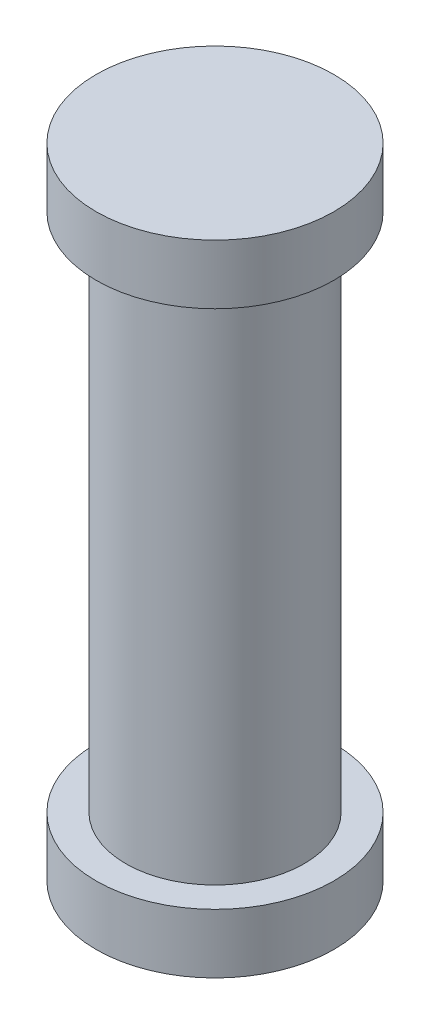
ISO-10303-21;
HEADER;
FILE_DESCRIPTION(('STEP AP214'),'2;1');
FILE_NAME('part.step','',(''),(''),'','','');
FILE_SCHEMA(('AUTOMOTIVE_DESIGN { 1 0 10303 214 1 1 1 1 }'));
ENDSEC;
DATA;
#1=APPLICATION_CONTEXT('core data for automotive mechanical design processes');
#2=APPLICATION_PROTOCOL_DEFINITION('international standard','automotive_design',2000,#1);
#3=PRODUCT_CONTEXT('',#1,'mechanical');
#4=PRODUCT('Part','Part','',(#3));
#5=PRODUCT_RELATED_PRODUCT_CATEGORY('part','',(#4));
#6=PRODUCT_DEFINITION_FORMATION('','',#4);
#7=PRODUCT_DEFINITION_CONTEXT('part definition',#1,'design');
#8=PRODUCT_DEFINITION('design','',#6,#7);
#9=PRODUCT_DEFINITION_SHAPE('','',#8);
#10=(LENGTH_UNIT() NAMED_UNIT(*) SI_UNIT(.MILLI.,.METRE.));
#11=(NAMED_UNIT(*) PLANE_ANGLE_UNIT() SI_UNIT($,.RADIAN.));
#12=(NAMED_UNIT(*) SI_UNIT($,.STERADIAN.) SOLID_ANGLE_UNIT());
#13=UNCERTAINTY_MEASURE_WITH_UNIT(LENGTH_MEASURE(1.E-05),#10,'distance_accuracy_value','');
#14=(GEOMETRIC_REPRESENTATION_CONTEXT(3) GLOBAL_UNCERTAINTY_ASSIGNED_CONTEXT((#13)) GLOBAL_UNIT_ASSIGNED_CONTEXT((#10,
#11,#12)) REPRESENTATION_CONTEXT('',''));
#15=CARTESIAN_POINT('',(0.,0.,0.));
#16=DIRECTION('',(0.,0.,1.));
#17=DIRECTION('',(1.,0.,0.));
#18=AXIS2_PLACEMENT_3D('',#15,#16,#17);
#19=CARTESIAN_POINT('',(0.,0.8,0.));
#20=DIRECTION('',(0.,-1.,0.));
#21=DIRECTION('',(0.,0.,-1.));
#22=AXIS2_PLACEMENT_3D('',#19,#20,#21);
#23=CYLINDRICAL_SURFACE('',#22,1.6);
#24=CARTESIAN_POINT('',(0.,0.8,0.));
#25=DIRECTION('',(0.,1.,0.));
#26=DIRECTION('',(0.,0.,1.));
#27=AXIS2_PLACEMENT_3D('',#24,#25,#26);
#28=CIRCLE('',#27,1.6);
#29=CARTESIAN_POINT('',(0.,0.8,1.6));
#30=VERTEX_POINT('',#29);
#31=EDGE_CURVE('E37',#30,#30,#28,.T.);
#32=ORIENTED_EDGE('',*,*,#31,.F.);
#33=EDGE_LOOP('',(#32));
#34=FACE_BOUND('',#33,.T.);
#35=CARTESIAN_POINT('',(0.,0.,0.));
#36=DIRECTION('',(0.,1.,0.));
#37=DIRECTION('',(0.,0.,1.));
#38=AXIS2_PLACEMENT_3D('',#35,#36,#37);
#39=CIRCLE('',#38,1.6);
#40=CARTESIAN_POINT('',(0.,0.,1.6));
#41=VERTEX_POINT('',#40);
#42=EDGE_CURVE('E33',#41,#41,#39,.T.);
#43=ORIENTED_EDGE('',*,*,#42,.T.);
#44=EDGE_LOOP('',(#43));
#45=FACE_BOUND('',#44,.T.);
#46=ADVANCED_FACE('F30',(#34,#45),#23,.T.);
#47=CARTESIAN_POINT('',(0.,0.8,0.));
#48=DIRECTION('',(0.,1.,0.));
#49=DIRECTION('',(0.,0.,1.));
#50=AXIS2_PLACEMENT_3D('',#47,#48,#49);
#51=PLANE('',#50);
#52=CARTESIAN_POINT('',(0.,0.8,0.));
#53=DIRECTION('',(0.,1.,0.));
#54=DIRECTION('',(0.,0.,1.));
#55=AXIS2_PLACEMENT_3D('',#52,#53,#54);
#56=CIRCLE('',#55,1.2);
#57=CARTESIAN_POINT('',(0.,0.8,1.2));
#58=VERTEX_POINT('',#57);
#59=EDGE_CURVE('E10',#58,#58,#56,.T.);
#60=ORIENTED_EDGE('',*,*,#59,.F.);
#61=EDGE_LOOP('',(#60));
#62=FACE_BOUND('',#61,.T.);
#63=ORIENTED_EDGE('',*,*,#31,.T.);
#64=EDGE_LOOP('',(#63));
#65=FACE_BOUND('',#64,.T.);
#66=ADVANCED_FACE('F71',(#62,#65),#51,.T.);
#67=CARTESIAN_POINT('',(0.,0.,0.));
#68=DIRECTION('',(0.,1.,0.));
#69=DIRECTION('',(0.,0.,1.));
#70=AXIS2_PLACEMENT_3D('',#67,#68,#69);
#71=PLANE('',#70);
#72=ORIENTED_EDGE('',*,*,#42,.F.);
#73=EDGE_LOOP('',(#72));
#74=FACE_BOUND('',#73,.T.);
#75=ADVANCED_FACE('F76',(#74),#71,.F.);
#76=CARTESIAN_POINT('',(0.,7.8,0.));
#77=DIRECTION('',(0.,-1.,0.));
#78=DIRECTION('',(0.,0.,-1.));
#79=AXIS2_PLACEMENT_3D('',#76,#77,#78);
#80=CYLINDRICAL_SURFACE('',#79,1.2);
#81=CARTESIAN_POINT('',(0.,7.8,0.));
#82=DIRECTION('',(0.,1.,0.));
#83=DIRECTION('',(0.,0.,1.));
#84=AXIS2_PLACEMENT_3D('',#81,#82,#83);
#85=CIRCLE('',#84,1.2);
#86=CARTESIAN_POINT('',(0.,7.8,1.2));
#87=VERTEX_POINT('',#86);
#88=EDGE_CURVE('E43',#87,#87,#85,.T.);
#89=ORIENTED_EDGE('',*,*,#88,.F.);
#90=EDGE_LOOP('',(#89));
#91=FACE_BOUND('',#90,.T.);
#92=ORIENTED_EDGE('',*,*,#59,.T.);
#93=EDGE_LOOP('',(#92));
#94=FACE_BOUND('',#93,.T.);
#95=ADVANCED_FACE('F58',(#91,#94),#80,.T.);
#96=CARTESIAN_POINT('',(0.,8.6,0.));
#97=DIRECTION('',(0.,-1.,0.));
#98=DIRECTION('',(0.,0.,-1.));
#99=AXIS2_PLACEMENT_3D('',#96,#97,#98);
#100=CYLINDRICAL_SURFACE('',#99,1.6);
#101=CARTESIAN_POINT('',(0.,8.6,0.));
#102=DIRECTION('',(0.,1.,0.));
#103=DIRECTION('',(0.,0.,1.));
#104=AXIS2_PLACEMENT_3D('',#101,#102,#103);
#105=CIRCLE('',#104,1.6);
#106=CARTESIAN_POINT('',(0.,8.6,1.6));
#107=VERTEX_POINT('',#106);
#108=EDGE_CURVE('E46',#107,#107,#105,.T.);
#109=ORIENTED_EDGE('',*,*,#108,.F.);
#110=EDGE_LOOP('',(#109));
#111=FACE_BOUND('',#110,.T.);
#112=CARTESIAN_POINT('',(0.,7.8,0.));
#113=DIRECTION('',(0.,1.,0.));
#114=DIRECTION('',(0.,0.,1.));
#115=AXIS2_PLACEMENT_3D('',#112,#113,#114);
#116=CIRCLE('',#115,1.6);
#117=CARTESIAN_POINT('',(0.,7.8,1.6));
#118=VERTEX_POINT('',#117);
#119=EDGE_CURVE('E47',#118,#118,#116,.T.);
#120=ORIENTED_EDGE('',*,*,#119,.T.);
#121=EDGE_LOOP('',(#120));
#122=FACE_BOUND('',#121,.T.);
#123=ADVANCED_FACE('F55',(#111,#122),#100,.T.);
#124=CARTESIAN_POINT('',(0.,8.6,0.));
#125=DIRECTION('',(0.,1.,0.));
#126=DIRECTION('',(0.,0.,1.));
#127=AXIS2_PLACEMENT_3D('',#124,#125,#126);
#128=PLANE('',#127);
#129=ORIENTED_EDGE('',*,*,#108,.T.);
#130=EDGE_LOOP('',(#129));
#131=FACE_BOUND('',#130,.T.);
#132=ADVANCED_FACE('F53',(#131),#128,.T.);
#133=CARTESIAN_POINT('',(0.,7.8,0.));
#134=DIRECTION('',(0.,1.,0.));
#135=DIRECTION('',(0.,0.,1.));
#136=AXIS2_PLACEMENT_3D('',#133,#134,#135);
#137=PLANE('',#136);
#138=ORIENTED_EDGE('',*,*,#88,.T.);
#139=EDGE_LOOP('',(#138));
#140=FACE_BOUND('',#139,.T.);
#141=ORIENTED_EDGE('',*,*,#119,.F.);
#142=EDGE_LOOP('',(#141));
#143=FACE_BOUND('',#142,.T.);
#144=ADVANCED_FACE('F62',(#140,#143),#137,.F.);
#145=CLOSED_SHELL('',(#46,#66,#75,#95,#123,#132,#144));
#146=MANIFOLD_SOLID_BREP('B2',#145);
#147=ADVANCED_BREP_SHAPE_REPRESENTATION('',(#18,#146),#14);
#148=SHAPE_DEFINITION_REPRESENTATION(#9,#147);
ENDSEC;
END-ISO-10303-21;
